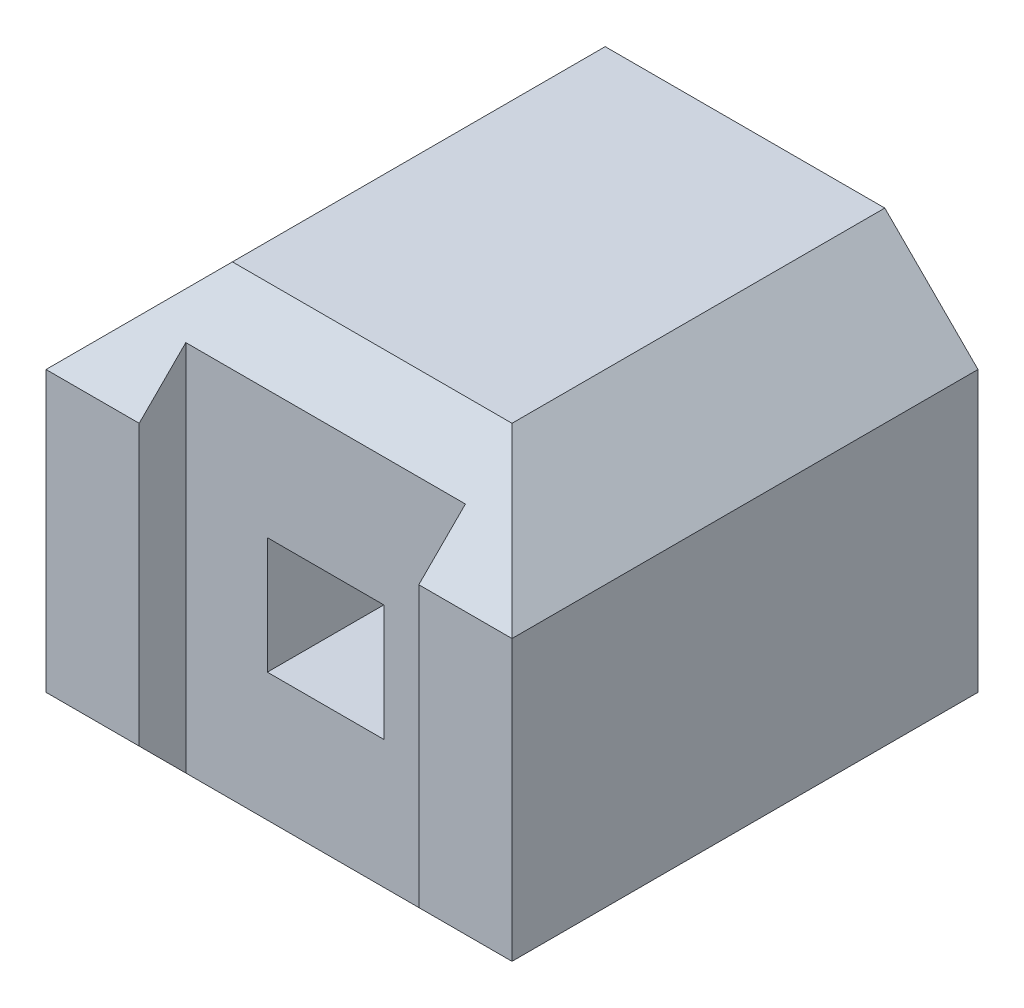
ISO-10303-21;
HEADER;
FILE_DESCRIPTION(('STEP AP214'),'2;1');
FILE_NAME('part.step','',(''),(''),'','','');
FILE_SCHEMA(('AUTOMOTIVE_DESIGN { 1 0 10303 214 1 1 1 1 }'));
ENDSEC;
DATA;
#1=APPLICATION_CONTEXT('core data for automotive mechanical design processes');
#2=APPLICATION_PROTOCOL_DEFINITION('international standard','automotive_design',2000,#1);
#3=PRODUCT_CONTEXT('',#1,'mechanical');
#4=PRODUCT('Part','Part','',(#3));
#5=PRODUCT_RELATED_PRODUCT_CATEGORY('part','',(#4));
#6=PRODUCT_DEFINITION_FORMATION('','',#4);
#7=PRODUCT_DEFINITION_CONTEXT('part definition',#1,'design');
#8=PRODUCT_DEFINITION('design','',#6,#7);
#9=PRODUCT_DEFINITION_SHAPE('','',#8);
#10=(LENGTH_UNIT() NAMED_UNIT(*) SI_UNIT(.MILLI.,.METRE.));
#11=(NAMED_UNIT(*) PLANE_ANGLE_UNIT() SI_UNIT($,.RADIAN.));
#12=(NAMED_UNIT(*) SI_UNIT($,.STERADIAN.) SOLID_ANGLE_UNIT());
#13=UNCERTAINTY_MEASURE_WITH_UNIT(LENGTH_MEASURE(1.E-05),#10,'distance_accuracy_value','');
#14=(GEOMETRIC_REPRESENTATION_CONTEXT(3) GLOBAL_UNCERTAINTY_ASSIGNED_CONTEXT((#13)) GLOBAL_UNIT_ASSIGNED_CONTEXT((#10,
#11,#12)) REPRESENTATION_CONTEXT('',''));
#15=CARTESIAN_POINT('',(0.,0.,0.));
#16=DIRECTION('',(0.,0.,1.));
#17=DIRECTION('',(1.,0.,0.));
#18=AXIS2_PLACEMENT_3D('',#15,#16,#17);
#19=CARTESIAN_POINT('',(1.27,6.35,2.54));
#20=DIRECTION('',(-1.,0.,0.));
#21=DIRECTION('',(0.,0.,1.));
#22=AXIS2_PLACEMENT_3D('',#19,#20,#21);
#23=PLANE('',#22);
#24=DIRECTION('',(0.,0.,1.));
#25=VECTOR('',#24,1.);
#26=CARTESIAN_POINT('',(1.27,8.382,2.54));
#27=LINE('',#26,#25);
#28=CARTESIAN_POINT('',(1.27,8.382,0.));
#29=VERTEX_POINT('',#28);
#30=CARTESIAN_POINT('',(1.27,8.382,2.54));
#31=VERTEX_POINT('',#30);
#32=EDGE_CURVE('E158',#29,#31,#27,.T.);
#33=ORIENTED_EDGE('',*,*,#32,.T.);
#34=DIRECTION('',(0.,1.,0.));
#35=VECTOR('',#34,1.);
#36=CARTESIAN_POINT('',(1.27,0.,2.54));
#37=LINE('',#36,#35);
#38=CARTESIAN_POINT('',(1.27,6.858,2.54));
#39=VERTEX_POINT('',#38);
#40=EDGE_CURVE('E127',#39,#31,#37,.T.);
#41=ORIENTED_EDGE('',*,*,#40,.F.);
#42=DIRECTION('',(0.,0.,1.));
#43=VECTOR('',#42,1.);
#44=CARTESIAN_POINT('',(1.27,6.858,2.54));
#45=LINE('',#44,#43);
#46=CARTESIAN_POINT('',(1.27,6.858,0.));
#47=VERTEX_POINT('',#46);
#48=EDGE_CURVE('E151',#39,#47,#45,.F.);
#49=ORIENTED_EDGE('',*,*,#48,.T.);
#50=DIRECTION('',(0.,1.,0.));
#51=VECTOR('',#50,1.);
#52=CARTESIAN_POINT('',(1.27,6.35,0.));
#53=LINE('',#52,#51);
#54=EDGE_CURVE('E19',#29,#47,#53,.F.);
#55=ORIENTED_EDGE('',*,*,#54,.F.);
#56=EDGE_LOOP('',(#33,#41,#49,#55));
#57=FACE_BOUND('',#56,.T.);
#58=ADVANCED_FACE('F16',(#57),#23,.F.);
#59=CARTESIAN_POINT('',(0.,0.,2.54));
#60=DIRECTION('',(0.,0.,1.));
#61=DIRECTION('',(1.,0.,0.));
#62=AXIS2_PLACEMENT_3D('',#59,#60,#61);
#63=PLANE('',#62);
#64=ORIENTED_EDGE('',*,*,#40,.T.);
#65=DIRECTION('',(1.,0.,0.));
#66=VECTOR('',#65,1.);
#67=CARTESIAN_POINT('',(0.,8.382,2.54));
#68=LINE('',#67,#66);
#69=CARTESIAN_POINT('',(0.762,8.382,2.54));
#70=VERTEX_POINT('',#69);
#71=EDGE_CURVE('E155',#31,#70,#68,.F.);
#72=ORIENTED_EDGE('',*,*,#71,.T.);
#73=DIRECTION('',(0.,-1.,0.));
#74=VECTOR('',#73,1.);
#75=CARTESIAN_POINT('',(0.762,8.89,2.54));
#76=LINE('',#75,#74);
#77=CARTESIAN_POINT('',(0.762,6.858,2.54));
#78=VERTEX_POINT('',#77);
#79=EDGE_CURVE('E134',#78,#70,#76,.F.);
#80=ORIENTED_EDGE('',*,*,#79,.F.);
#81=DIRECTION('',(1.,0.,0.));
#82=VECTOR('',#81,1.);
#83=CARTESIAN_POINT('',(0.,6.858,2.54));
#84=LINE('',#83,#82);
#85=EDGE_CURVE('E130',#78,#39,#84,.T.);
#86=ORIENTED_EDGE('',*,*,#85,.T.);
#87=EDGE_LOOP('',(#64,#72,#80,#86));
#88=FACE_BOUND('',#87,.T.);
#89=ADVANCED_FACE('F132',(#88),#63,.T.);
#90=CARTESIAN_POINT('',(1.27,6.858,2.54));
#91=DIRECTION('',(-0.707106781186548,0.707106781186548,0.));
#92=DIRECTION('',(-0.707106781186548,-0.707106781186548,0.));
#93=AXIS2_PLACEMENT_3D('',#90,#91,#92);
#94=PLANE('',#93);
#95=ORIENTED_EDGE('',*,*,#48,.F.);
#96=DIRECTION('',(0.577350269189626,0.577350269189626,0.577350269189626));
#97=VECTOR('',#96,1.);
#98=CARTESIAN_POINT('',(0.762,6.35,2.032));
#99=LINE('',#98,#97);
#100=CARTESIAN_POINT('',(0.762,6.35,2.032));
#101=VERTEX_POINT('',#100);
#102=EDGE_CURVE('E138',#101,#39,#99,.T.);
#103=ORIENTED_EDGE('',*,*,#102,.F.);
#104=DIRECTION('',(0.,0.,1.));
#105=VECTOR('',#104,1.);
#106=CARTESIAN_POINT('',(0.762,6.35,2.54));
#107=LINE('',#106,#105);
#108=CARTESIAN_POINT('',(0.762,6.35,0.));
#109=VERTEX_POINT('',#108);
#110=EDGE_CURVE('E182',#101,#109,#107,.F.);
#111=ORIENTED_EDGE('',*,*,#110,.T.);
#112=DIRECTION('',(-0.707106781186548,-0.707106781186548,0.));
#113=VECTOR('',#112,1.);
#114=CARTESIAN_POINT('',(1.27,6.858,0.));
#115=LINE('',#114,#113);
#116=EDGE_CURVE('E153',#47,#109,#115,.T.);
#117=ORIENTED_EDGE('',*,*,#116,.F.);
#118=EDGE_LOOP('',(#95,#103,#111,#117));
#119=FACE_BOUND('',#118,.T.);
#120=ADVANCED_FACE('F152',(#119),#94,.F.);
#121=CARTESIAN_POINT('',(0.762,8.89,2.54));
#122=DIRECTION('',(-0.707106781186547,-0.707106781186548,0.));
#123=DIRECTION('',(0.707106781186548,-0.707106781186547,0.));
#124=AXIS2_PLACEMENT_3D('',#121,#122,#123);
#125=PLANE('',#124);
#126=DIRECTION('',(0.,0.,-1.));
#127=VECTOR('',#126,1.);
#128=CARTESIAN_POINT('',(0.762,8.89,2.54));
#129=LINE('',#128,#127);
#130=CARTESIAN_POINT('',(0.762,8.89,0.));
#131=VERTEX_POINT('',#130);
#132=CARTESIAN_POINT('',(0.762,8.89,2.032));
#133=VERTEX_POINT('',#132);
#134=EDGE_CURVE('E186',#131,#133,#129,.F.);
#135=ORIENTED_EDGE('',*,*,#134,.T.);
#136=DIRECTION('',(-0.577350269189626,0.577350269189626,-0.577350269189626));
#137=VECTOR('',#136,1.);
#138=CARTESIAN_POINT('',(1.27,8.382,2.54));
#139=LINE('',#138,#137);
#140=EDGE_CURVE('E165',#31,#133,#139,.T.);
#141=ORIENTED_EDGE('',*,*,#140,.F.);
#142=ORIENTED_EDGE('',*,*,#32,.F.);
#143=DIRECTION('',(0.707106781186548,-0.707106781186547,0.));
#144=VECTOR('',#143,1.);
#145=CARTESIAN_POINT('',(0.762,8.89,0.));
#146=LINE('',#145,#144);
#147=EDGE_CURVE('E167',#131,#29,#146,.T.);
#148=ORIENTED_EDGE('',*,*,#147,.F.);
#149=EDGE_LOOP('',(#135,#141,#142,#148));
#150=FACE_BOUND('',#149,.T.);
#151=ADVANCED_FACE('F357',(#150),#125,.F.);
#152=CARTESIAN_POINT('',(0.762,8.89,2.286));
#153=DIRECTION('',(-1.,0.,0.));
#154=DIRECTION('',(0.,-1.,0.));
#155=AXIS2_PLACEMENT_3D('',#152,#153,#154);
#156=PLANE('',#155);
#157=ORIENTED_EDGE('',*,*,#79,.T.);
#158=DIRECTION('',(0.,-0.707106781186547,0.707106781186548));
#159=VECTOR('',#158,1.);
#160=CARTESIAN_POINT('',(0.762,8.382,2.54));
#161=LINE('',#160,#159);
#162=CARTESIAN_POINT('',(0.762,8.636,2.286));
#163=VERTEX_POINT('',#162);
#164=EDGE_CURVE('E196',#163,#70,#161,.T.);
#165=ORIENTED_EDGE('',*,*,#164,.F.);
#166=DIRECTION('',(0.,1.,0.));
#167=VECTOR('',#166,1.);
#168=CARTESIAN_POINT('',(0.762,0.,2.286));
#169=LINE('',#168,#167);
#170=CARTESIAN_POINT('',(0.762,6.604,2.286));
#171=VERTEX_POINT('',#170);
#172=EDGE_CURVE('E211',#163,#171,#169,.F.);
#173=ORIENTED_EDGE('',*,*,#172,.T.);
#174=DIRECTION('',(0.,-0.707106781186547,-0.707106781186548));
#175=VECTOR('',#174,1.);
#176=CARTESIAN_POINT('',(0.762,6.858,2.54));
#177=LINE('',#176,#175);
#178=EDGE_CURVE('E146',#78,#171,#177,.T.);
#179=ORIENTED_EDGE('',*,*,#178,.F.);
#180=EDGE_LOOP('',(#157,#165,#173,#179));
#181=FACE_BOUND('',#180,.T.);
#182=ADVANCED_FACE('F292',(#181),#156,.T.);
#183=CARTESIAN_POINT('',(-0.762,6.35,2.286));
#184=DIRECTION('',(1.,0.,0.));
#185=DIRECTION('',(0.,0.,-1.));
#186=AXIS2_PLACEMENT_3D('',#183,#184,#185);
#187=PLANE('',#186);
#188=DIRECTION('',(0.,1.,0.));
#189=VECTOR('',#188,1.);
#190=CARTESIAN_POINT('',(-0.762,0.,2.286));
#191=LINE('',#190,#189);
#192=CARTESIAN_POINT('',(-0.762,6.604,2.286));
#193=VERTEX_POINT('',#192);
#194=CARTESIAN_POINT('',(-0.762,8.636,2.286));
#195=VERTEX_POINT('',#194);
#196=EDGE_CURVE('E217',#193,#195,#191,.T.);
#197=ORIENTED_EDGE('',*,*,#196,.T.);
#198=DIRECTION('',(0.,-0.707106781186547,0.707106781186548));
#199=VECTOR('',#198,1.);
#200=CARTESIAN_POINT('',(-0.762,8.382,2.54));
#201=LINE('',#200,#199);
#202=CARTESIAN_POINT('',(-0.762,8.382,2.54));
#203=VERTEX_POINT('',#202);
#204=EDGE_CURVE('E194',#203,#195,#201,.F.);
#205=ORIENTED_EDGE('',*,*,#204,.F.);
#206=DIRECTION('',(0.,1.,0.));
#207=VECTOR('',#206,1.);
#208=CARTESIAN_POINT('',(-0.762,6.35,2.54));
#209=LINE('',#208,#207);
#210=CARTESIAN_POINT('',(-0.762,6.858,2.54));
#211=VERTEX_POINT('',#210);
#212=EDGE_CURVE('E171',#203,#211,#209,.F.);
#213=ORIENTED_EDGE('',*,*,#212,.T.);
#214=DIRECTION('',(0.,-0.707106781186547,-0.707106781186548));
#215=VECTOR('',#214,1.);
#216=CARTESIAN_POINT('',(-0.762,6.858,2.54));
#217=LINE('',#216,#215);
#218=EDGE_CURVE('E176',#193,#211,#217,.F.);
#219=ORIENTED_EDGE('',*,*,#218,.F.);
#220=EDGE_LOOP('',(#197,#205,#213,#219));
#221=FACE_BOUND('',#220,.T.);
#222=ADVANCED_FACE('F283',(#221),#187,.T.);
#223=CARTESIAN_POINT('',(0.3175,7.3025,2.794));
#224=DIRECTION('',(0.,-1.,0.));
#225=DIRECTION('',(0.,0.,-1.));
#226=AXIS2_PLACEMENT_3D('',#223,#224,#225);
#227=PLANE('',#226);
#228=DIRECTION('',(-1.,0.,0.));
#229=VECTOR('',#228,1.);
#230=CARTESIAN_POINT('',(0.,7.3025,2.286));
#231=LINE('',#230,#229);
#232=CARTESIAN_POINT('',(-0.3175,7.3025,2.286));
#233=VERTEX_POINT('',#232);
#234=CARTESIAN_POINT('',(0.3175,7.3025,2.286));
#235=VERTEX_POINT('',#234);
#236=EDGE_CURVE('E209',#233,#235,#231,.F.);
#237=ORIENTED_EDGE('',*,*,#236,.T.);
#238=DIRECTION('',(0.,0.,-1.));
#239=VECTOR('',#238,1.);
#240=CARTESIAN_POINT('',(0.3175,7.3025,2.794));
#241=LINE('',#240,#239);
#242=CARTESIAN_POINT('',(0.3175,7.3025,0.));
#243=VERTEX_POINT('',#242);
#244=EDGE_CURVE('E228',#235,#243,#241,.T.);
#245=ORIENTED_EDGE('',*,*,#244,.T.);
#246=DIRECTION('',(1.,0.,0.));
#247=VECTOR('',#246,1.);
#248=CARTESIAN_POINT('',(0.3175,7.3025,0.));
#249=LINE('',#248,#247);
#250=CARTESIAN_POINT('',(-0.3175,7.3025,0.));
#251=VERTEX_POINT('',#250);
#252=EDGE_CURVE('E173',#251,#243,#249,.T.);
#253=ORIENTED_EDGE('',*,*,#252,.F.);
#254=DIRECTION('',(0.,0.,1.));
#255=VECTOR('',#254,1.);
#256=CARTESIAN_POINT('',(-0.3175,7.3025,2.794));
#257=LINE('',#256,#255);
#258=EDGE_CURVE('E204',#251,#233,#257,.T.);
#259=ORIENTED_EDGE('',*,*,#258,.T.);
#260=EDGE_LOOP('',(#237,#245,#253,#259));
#261=FACE_BOUND('',#260,.T.);
#262=ADVANCED_FACE('F281',(#261),#227,.F.);
#263=CARTESIAN_POINT('',(0.,6.858,2.54));
#264=DIRECTION('',(0.,-0.707106781186548,0.707106781186547));
#265=DIRECTION('',(0.,-0.707106781186547,-0.707106781186548));
#266=AXIS2_PLACEMENT_3D('',#263,#264,#265);
#267=PLANE('',#266);
#268=ORIENTED_EDGE('',*,*,#85,.F.);
#269=ORIENTED_EDGE('',*,*,#178,.T.);
#270=DIRECTION('',(-1.,0.,0.));
#271=VECTOR('',#270,1.);
#272=CARTESIAN_POINT('',(0.,6.604,2.286));
#273=LINE('',#272,#271);
#274=EDGE_CURVE('E214',#171,#193,#273,.T.);
#275=ORIENTED_EDGE('',*,*,#274,.T.);
#276=ORIENTED_EDGE('',*,*,#218,.T.);
#277=DIRECTION('',(1.,0.,0.));
#278=VECTOR('',#277,1.);
#279=CARTESIAN_POINT('',(0.,6.858,2.54));
#280=LINE('',#279,#278);
#281=CARTESIAN_POINT('',(-1.27,6.858,2.54));
#282=VERTEX_POINT('',#281);
#283=EDGE_CURVE('E147',#211,#282,#280,.F.);
#284=ORIENTED_EDGE('',*,*,#283,.T.);
#285=DIRECTION('',(0.577350269189626,-0.577350269189626,-0.577350269189626));
#286=VECTOR('',#285,1.);
#287=CARTESIAN_POINT('',(-1.27,6.858,2.54));
#288=LINE('',#287,#286);
#289=CARTESIAN_POINT('',(-0.762,6.35,2.032));
#290=VERTEX_POINT('',#289);
#291=EDGE_CURVE('E231',#282,#290,#288,.T.);
#292=ORIENTED_EDGE('',*,*,#291,.T.);
#293=DIRECTION('',(1.,0.,0.));
#294=VECTOR('',#293,1.);
#295=CARTESIAN_POINT('',(-1.27,6.35,2.032));
#296=LINE('',#295,#294);
#297=EDGE_CURVE('E142',#290,#101,#296,.T.);
#298=ORIENTED_EDGE('',*,*,#297,.T.);
#299=ORIENTED_EDGE('',*,*,#102,.T.);
#300=EDGE_LOOP('',(#268,#269,#275,#276,#284,#292,#298,#299));
#301=FACE_BOUND('',#300,.T.);
#302=ADVANCED_FACE('F140',(#301),#267,.T.);
#303=CARTESIAN_POINT('',(-1.27,6.35,2.54));
#304=DIRECTION('',(0.,1.,0.));
#305=DIRECTION('',(0.,0.,1.));
#306=AXIS2_PLACEMENT_3D('',#303,#304,#305);
#307=PLANE('',#306);
#308=ORIENTED_EDGE('',*,*,#110,.F.);
#309=ORIENTED_EDGE('',*,*,#297,.F.);
#310=DIRECTION('',(0.,0.,1.));
#311=VECTOR('',#310,1.);
#312=CARTESIAN_POINT('',(-0.762,6.35,2.54));
#313=LINE('',#312,#311);
#314=CARTESIAN_POINT('',(-0.762,6.35,0.));
#315=VERTEX_POINT('',#314);
#316=EDGE_CURVE('E233',#290,#315,#313,.F.);
#317=ORIENTED_EDGE('',*,*,#316,.T.);
#318=DIRECTION('',(1.,0.,0.));
#319=VECTOR('',#318,1.);
#320=CARTESIAN_POINT('',(-1.27,6.35,0.));
#321=LINE('',#320,#319);
#322=EDGE_CURVE('E184',#109,#315,#321,.F.);
#323=ORIENTED_EDGE('',*,*,#322,.F.);
#324=EDGE_LOOP('',(#308,#309,#317,#323));
#325=FACE_BOUND('',#324,.T.);
#326=ADVANCED_FACE('F290',(#325),#307,.F.);
#327=CARTESIAN_POINT('',(1.27,8.89,2.54));
#328=DIRECTION('',(0.,-1.,0.));
#329=DIRECTION('',(0.,0.,-1.));
#330=AXIS2_PLACEMENT_3D('',#327,#328,#329);
#331=PLANE('',#330);
#332=DIRECTION('',(0.,0.,1.));
#333=VECTOR('',#332,1.);
#334=CARTESIAN_POINT('',(-0.762,8.89,2.54));
#335=LINE('',#334,#333);
#336=CARTESIAN_POINT('',(-0.762,8.89,0.));
#337=VERTEX_POINT('',#336);
#338=CARTESIAN_POINT('',(-0.762,8.89,2.032));
#339=VERTEX_POINT('',#338);
#340=EDGE_CURVE('E238',#337,#339,#335,.T.);
#341=ORIENTED_EDGE('',*,*,#340,.T.);
#342=DIRECTION('',(1.,0.,0.));
#343=VECTOR('',#342,1.);
#344=CARTESIAN_POINT('',(0.,8.89,2.032));
#345=LINE('',#344,#343);
#346=EDGE_CURVE('E199',#133,#339,#345,.F.);
#347=ORIENTED_EDGE('',*,*,#346,.F.);
#348=ORIENTED_EDGE('',*,*,#134,.F.);
#349=DIRECTION('',(1.,0.,0.));
#350=VECTOR('',#349,1.);
#351=CARTESIAN_POINT('',(1.27,8.89,0.));
#352=LINE('',#351,#350);
#353=EDGE_CURVE('E189',#337,#131,#352,.T.);
#354=ORIENTED_EDGE('',*,*,#353,.F.);
#355=EDGE_LOOP('',(#341,#347,#348,#354));
#356=FACE_BOUND('',#355,.T.);
#357=ADVANCED_FACE('F328',(#356),#331,.F.);
#358=CARTESIAN_POINT('',(0.,8.382,2.54));
#359=DIRECTION('',(0.,0.707106781186548,0.707106781186547));
#360=DIRECTION('',(0.,-0.707106781186547,0.707106781186548));
#361=AXIS2_PLACEMENT_3D('',#358,#359,#360);
#362=PLANE('',#361);
#363=ORIENTED_EDGE('',*,*,#346,.T.);
#364=DIRECTION('',(-0.577350269189626,-0.577350269189626,0.577350269189626));
#365=VECTOR('',#364,1.);
#366=CARTESIAN_POINT('',(-0.762,8.89,2.032));
#367=LINE('',#366,#365);
#368=CARTESIAN_POINT('',(-1.27,8.382,2.54));
#369=VERTEX_POINT('',#368);
#370=EDGE_CURVE('E241',#339,#369,#367,.T.);
#371=ORIENTED_EDGE('',*,*,#370,.T.);
#372=DIRECTION('',(1.,0.,0.));
#373=VECTOR('',#372,1.);
#374=CARTESIAN_POINT('',(0.,8.382,2.54));
#375=LINE('',#374,#373);
#376=EDGE_CURVE('E192',#369,#203,#375,.T.);
#377=ORIENTED_EDGE('',*,*,#376,.T.);
#378=ORIENTED_EDGE('',*,*,#204,.T.);
#379=DIRECTION('',(-1.,0.,0.));
#380=VECTOR('',#379,1.);
#381=CARTESIAN_POINT('',(0.,8.636,2.286));
#382=LINE('',#381,#380);
#383=EDGE_CURVE('E220',#195,#163,#382,.F.);
#384=ORIENTED_EDGE('',*,*,#383,.T.);
#385=ORIENTED_EDGE('',*,*,#164,.T.);
#386=ORIENTED_EDGE('',*,*,#71,.F.);
#387=ORIENTED_EDGE('',*,*,#140,.T.);
#388=EDGE_LOOP('',(#363,#371,#377,#378,#384,#385,#386,#387));
#389=FACE_BOUND('',#388,.T.);
#390=ADVANCED_FACE('F325',(#389),#362,.T.);
#391=CARTESIAN_POINT('',(-0.3175,7.3025,2.794));
#392=DIRECTION('',(-1.,0.,0.));
#393=DIRECTION('',(0.,0.,1.));
#394=AXIS2_PLACEMENT_3D('',#391,#392,#393);
#395=PLANE('',#394);
#396=DIRECTION('',(0.,1.,0.));
#397=VECTOR('',#396,1.);
#398=CARTESIAN_POINT('',(-0.3175,0.,2.286));
#399=LINE('',#398,#397);
#400=CARTESIAN_POINT('',(-0.3175,7.9375,2.286));
#401=VERTEX_POINT('',#400);
#402=EDGE_CURVE('E206',#401,#233,#399,.F.);
#403=ORIENTED_EDGE('',*,*,#402,.T.);
#404=ORIENTED_EDGE('',*,*,#258,.F.);
#405=DIRECTION('',(0.,1.,0.));
#406=VECTOR('',#405,1.);
#407=CARTESIAN_POINT('',(-0.3175,7.3025,0.));
#408=LINE('',#407,#406);
#409=CARTESIAN_POINT('',(-0.3175,7.9375,0.));
#410=VERTEX_POINT('',#409);
#411=EDGE_CURVE('E201',#410,#251,#408,.F.);
#412=ORIENTED_EDGE('',*,*,#411,.F.);
#413=DIRECTION('',(0.,0.,1.));
#414=VECTOR('',#413,1.);
#415=CARTESIAN_POINT('',(-0.3175,7.9375,2.794));
#416=LINE('',#415,#414);
#417=EDGE_CURVE('E245',#410,#401,#416,.T.);
#418=ORIENTED_EDGE('',*,*,#417,.T.);
#419=EDGE_LOOP('',(#403,#404,#412,#418));
#420=FACE_BOUND('',#419,.T.);
#421=ADVANCED_FACE('F278',(#420),#395,.F.);
#422=CARTESIAN_POINT('',(0.,0.,2.286));
#423=DIRECTION('',(0.,0.,-1.));
#424=DIRECTION('',(-1.,0.,0.));
#425=AXIS2_PLACEMENT_3D('',#422,#423,#424);
#426=PLANE('',#425);
#427=ORIENTED_EDGE('',*,*,#196,.F.);
#428=ORIENTED_EDGE('',*,*,#274,.F.);
#429=ORIENTED_EDGE('',*,*,#172,.F.);
#430=ORIENTED_EDGE('',*,*,#383,.F.);
#431=EDGE_LOOP('',(#427,#428,#429,#430));
#432=FACE_BOUND('',#431,.T.);
#433=ORIENTED_EDGE('',*,*,#402,.F.);
#434=DIRECTION('',(1.,0.,0.));
#435=VECTOR('',#434,1.);
#436=CARTESIAN_POINT('',(-0.3175,7.9375,2.286));
#437=LINE('',#436,#435);
#438=CARTESIAN_POINT('',(0.3175,7.9375,2.286));
#439=VERTEX_POINT('',#438);
#440=EDGE_CURVE('E248',#401,#439,#437,.T.);
#441=ORIENTED_EDGE('',*,*,#440,.T.);
#442=DIRECTION('',(0.,1.,0.));
#443=VECTOR('',#442,1.);
#444=CARTESIAN_POINT('',(0.3175,7.9375,2.286));
#445=LINE('',#444,#443);
#446=EDGE_CURVE('E225',#439,#235,#445,.F.);
#447=ORIENTED_EDGE('',*,*,#446,.T.);
#448=ORIENTED_EDGE('',*,*,#236,.F.);
#449=EDGE_LOOP('',(#433,#441,#447,#448));
#450=FACE_BOUND('',#449,.T.);
#451=ADVANCED_FACE('F276',(#432,#450),#426,.F.);
#452=CARTESIAN_POINT('',(0.3175,7.9375,2.794));
#453=DIRECTION('',(1.,0.,0.));
#454=DIRECTION('',(0.,0.,-1.));
#455=AXIS2_PLACEMENT_3D('',#452,#453,#454);
#456=PLANE('',#455);
#457=ORIENTED_EDGE('',*,*,#446,.F.);
#458=DIRECTION('',(0.,0.,1.));
#459=VECTOR('',#458,1.);
#460=CARTESIAN_POINT('',(0.3175,7.9375,2.794));
#461=LINE('',#460,#459);
#462=CARTESIAN_POINT('',(0.3175,7.9375,0.));
#463=VERTEX_POINT('',#462);
#464=EDGE_CURVE('E251',#439,#463,#461,.F.);
#465=ORIENTED_EDGE('',*,*,#464,.T.);
#466=DIRECTION('',(0.,1.,0.));
#467=VECTOR('',#466,1.);
#468=CARTESIAN_POINT('',(0.3175,7.9375,0.));
#469=LINE('',#468,#467);
#470=EDGE_CURVE('E223',#243,#463,#469,.T.);
#471=ORIENTED_EDGE('',*,*,#470,.F.);
#472=ORIENTED_EDGE('',*,*,#244,.F.);
#473=EDGE_LOOP('',(#457,#465,#471,#472));
#474=FACE_BOUND('',#473,.T.);
#475=ADVANCED_FACE('F273',(#474),#456,.F.);
#476=CARTESIAN_POINT('',(-0.762,6.35,2.54));
#477=DIRECTION('',(0.707106781186547,0.707106781186548,0.));
#478=DIRECTION('',(-0.707106781186548,0.707106781186547,0.));
#479=AXIS2_PLACEMENT_3D('',#476,#477,#478);
#480=PLANE('',#479);
#481=ORIENTED_EDGE('',*,*,#316,.F.);
#482=ORIENTED_EDGE('',*,*,#291,.F.);
#483=DIRECTION('',(0.,0.,-1.));
#484=VECTOR('',#483,1.);
#485=CARTESIAN_POINT('',(-1.27,6.858,2.54));
#486=LINE('',#485,#484);
#487=CARTESIAN_POINT('',(-1.27,6.858,0.));
#488=VERTEX_POINT('',#487);
#489=EDGE_CURVE('E254',#282,#488,#486,.T.);
#490=ORIENTED_EDGE('',*,*,#489,.T.);
#491=DIRECTION('',(-0.707106781186548,0.707106781186547,0.));
#492=VECTOR('',#491,1.);
#493=CARTESIAN_POINT('',(-0.762,6.35,0.));
#494=LINE('',#493,#492);
#495=EDGE_CURVE('E236',#315,#488,#494,.T.);
#496=ORIENTED_EDGE('',*,*,#495,.F.);
#497=EDGE_LOOP('',(#481,#482,#490,#496));
#498=FACE_BOUND('',#497,.T.);
#499=ADVANCED_FACE('F314',(#498),#480,.F.);
#500=CARTESIAN_POINT('',(-1.27,8.382,2.54));
#501=DIRECTION('',(0.707106781186548,-0.707106781186548,0.));
#502=DIRECTION('',(0.707106781186548,0.707106781186548,0.));
#503=AXIS2_PLACEMENT_3D('',#500,#501,#502);
#504=PLANE('',#503);
#505=DIRECTION('',(0.,0.,-1.));
#506=VECTOR('',#505,1.);
#507=CARTESIAN_POINT('',(-1.27,8.382,2.54));
#508=LINE('',#507,#506);
#509=CARTESIAN_POINT('',(-1.27,8.382,0.));
#510=VERTEX_POINT('',#509);
#511=EDGE_CURVE('E257',#510,#369,#508,.F.);
#512=ORIENTED_EDGE('',*,*,#511,.T.);
#513=ORIENTED_EDGE('',*,*,#370,.F.);
#514=ORIENTED_EDGE('',*,*,#340,.F.);
#515=DIRECTION('',(0.707106781186548,0.707106781186548,0.));
#516=VECTOR('',#515,1.);
#517=CARTESIAN_POINT('',(-1.27,8.382,0.));
#518=LINE('',#517,#516);
#519=EDGE_CURVE('E34',#510,#337,#518,.T.);
#520=ORIENTED_EDGE('',*,*,#519,.F.);
#521=EDGE_LOOP('',(#512,#513,#514,#520));
#522=FACE_BOUND('',#521,.T.);
#523=ADVANCED_FACE('F310',(#522),#504,.F.);
#524=CARTESIAN_POINT('',(0.,0.,2.54));
#525=DIRECTION('',(0.,0.,1.));
#526=DIRECTION('',(1.,0.,0.));
#527=AXIS2_PLACEMENT_3D('',#524,#525,#526);
#528=PLANE('',#527);
#529=DIRECTION('',(0.,1.,0.));
#530=VECTOR('',#529,1.);
#531=CARTESIAN_POINT('',(-1.27,8.89,2.54));
#532=LINE('',#531,#530);
#533=EDGE_CURVE('E259',#369,#282,#532,.F.);
#534=ORIENTED_EDGE('',*,*,#533,.T.);
#535=ORIENTED_EDGE('',*,*,#283,.F.);
#536=ORIENTED_EDGE('',*,*,#212,.F.);
#537=ORIENTED_EDGE('',*,*,#376,.F.);
#538=EDGE_LOOP('',(#534,#535,#536,#537));
#539=FACE_BOUND('',#538,.T.);
#540=ADVANCED_FACE('F307',(#539),#528,.T.);
#541=CARTESIAN_POINT('',(-0.3175,7.9375,2.794));
#542=DIRECTION('',(0.,1.,0.));
#543=DIRECTION('',(0.,0.,1.));
#544=AXIS2_PLACEMENT_3D('',#541,#542,#543);
#545=PLANE('',#544);
#546=ORIENTED_EDGE('',*,*,#440,.F.);
#547=ORIENTED_EDGE('',*,*,#417,.F.);
#548=DIRECTION('',(1.,0.,0.));
#549=VECTOR('',#548,1.);
#550=CARTESIAN_POINT('',(0.,7.9375,0.));
#551=LINE('',#550,#549);
#552=EDGE_CURVE('E25',#410,#463,#551,.T.);
#553=ORIENTED_EDGE('',*,*,#552,.T.);
#554=ORIENTED_EDGE('',*,*,#464,.F.);
#555=EDGE_LOOP('',(#546,#547,#553,#554));
#556=FACE_BOUND('',#555,.T.);
#557=ADVANCED_FACE('F268',(#556),#545,.F.);
#558=CARTESIAN_POINT('',(-1.27,8.89,2.54));
#559=DIRECTION('',(1.,0.,0.));
#560=DIRECTION('',(0.,0.,-1.));
#561=AXIS2_PLACEMENT_3D('',#558,#559,#560);
#562=PLANE('',#561);
#563=ORIENTED_EDGE('',*,*,#511,.F.);
#564=DIRECTION('',(0.,1.,0.));
#565=VECTOR('',#564,1.);
#566=CARTESIAN_POINT('',(-1.27,0.,0.));
#567=LINE('',#566,#565);
#568=EDGE_CURVE('E11',#510,#488,#567,.F.);
#569=ORIENTED_EDGE('',*,*,#568,.T.);
#570=ORIENTED_EDGE('',*,*,#489,.F.);
#571=ORIENTED_EDGE('',*,*,#533,.F.);
#572=EDGE_LOOP('',(#563,#569,#570,#571));
#573=FACE_BOUND('',#572,.T.);
#574=ADVANCED_FACE('F296',(#573),#562,.F.);
#575=CARTESIAN_POINT('',(0.,0.,0.));
#576=DIRECTION('',(0.,0.,1.));
#577=DIRECTION('',(1.,0.,0.));
#578=AXIS2_PLACEMENT_3D('',#575,#576,#577);
#579=PLANE('',#578);
#580=ORIENTED_EDGE('',*,*,#519,.T.);
#581=ORIENTED_EDGE('',*,*,#353,.T.);
#582=ORIENTED_EDGE('',*,*,#147,.T.);
#583=ORIENTED_EDGE('',*,*,#54,.T.);
#584=ORIENTED_EDGE('',*,*,#116,.T.);
#585=ORIENTED_EDGE('',*,*,#322,.T.);
#586=ORIENTED_EDGE('',*,*,#495,.T.);
#587=ORIENTED_EDGE('',*,*,#568,.F.);
#588=EDGE_LOOP('',(#580,#581,#582,#583,#584,#585,#586,#587));
#589=FACE_BOUND('',#588,.T.);
#590=ORIENTED_EDGE('',*,*,#411,.T.);
#591=ORIENTED_EDGE('',*,*,#252,.T.);
#592=ORIENTED_EDGE('',*,*,#470,.T.);
#593=ORIENTED_EDGE('',*,*,#552,.F.);
#594=EDGE_LOOP('',(#590,#591,#592,#593));
#595=FACE_BOUND('',#594,.T.);
#596=ADVANCED_FACE('F270',(#589,#595),#579,.F.);
#597=CLOSED_SHELL('',(#58,#89,#120,#151,#182,#222,#262,#302,#326,#357,#390,#421,#451,#475,#499,
#523,#540,#557,#574,#596));
#598=MANIFOLD_SOLID_BREP('B1',#597);
#599=ADVANCED_BREP_SHAPE_REPRESENTATION('',(#18,#598),#14);
#600=SHAPE_DEFINITION_REPRESENTATION(#9,#599);
ENDSEC;
END-ISO-10303-21;
